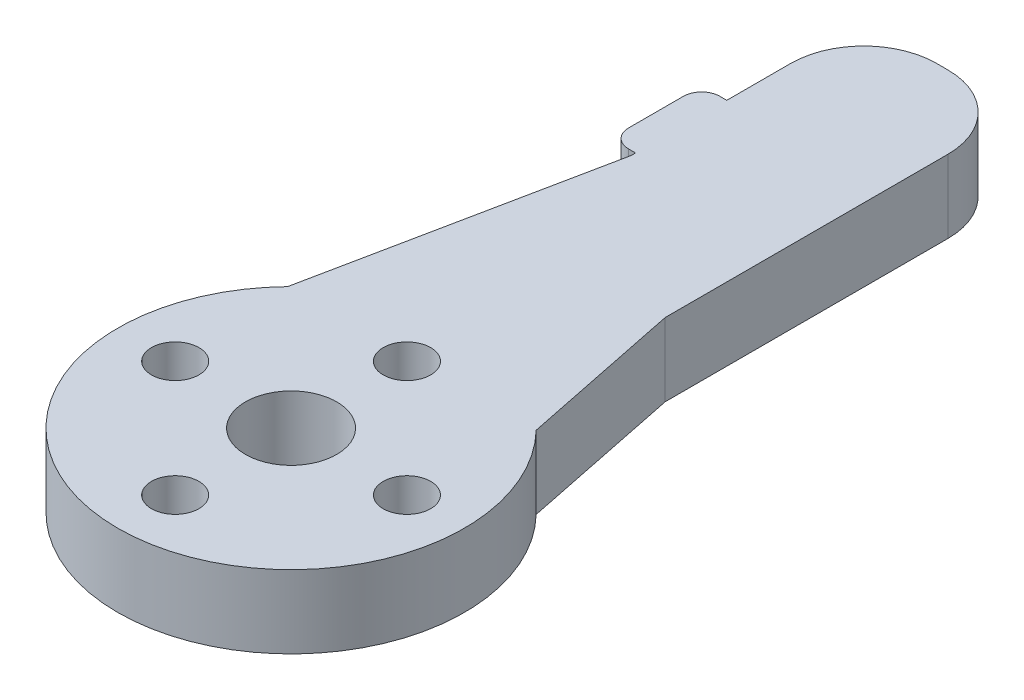
ISO-10303-21;
HEADER;
FILE_DESCRIPTION(('STEP AP214'),'2;1');
FILE_NAME('part.step','',(''),(''),'','','');
FILE_SCHEMA(('AUTOMOTIVE_DESIGN { 1 0 10303 214 1 1 1 1 }'));
ENDSEC;
DATA;
#1=APPLICATION_CONTEXT('core data for automotive mechanical design processes');
#2=APPLICATION_PROTOCOL_DEFINITION('international standard','automotive_design',2000,#1);
#3=PRODUCT_CONTEXT('',#1,'mechanical');
#4=PRODUCT('Part','Part','',(#3));
#5=PRODUCT_RELATED_PRODUCT_CATEGORY('part','',(#4));
#6=PRODUCT_DEFINITION_FORMATION('','',#4);
#7=PRODUCT_DEFINITION_CONTEXT('part definition',#1,'design');
#8=PRODUCT_DEFINITION('design','',#6,#7);
#9=PRODUCT_DEFINITION_SHAPE('','',#8);
#10=(LENGTH_UNIT() NAMED_UNIT(*) SI_UNIT(.MILLI.,.METRE.));
#11=(NAMED_UNIT(*) PLANE_ANGLE_UNIT() SI_UNIT($,.RADIAN.));
#12=(NAMED_UNIT(*) SI_UNIT($,.STERADIAN.) SOLID_ANGLE_UNIT());
#13=UNCERTAINTY_MEASURE_WITH_UNIT(LENGTH_MEASURE(1.E-05),#10,'distance_accuracy_value','');
#14=(GEOMETRIC_REPRESENTATION_CONTEXT(3) GLOBAL_UNCERTAINTY_ASSIGNED_CONTEXT((#13)) GLOBAL_UNIT_ASSIGNED_CONTEXT((#10,
#11,#12)) REPRESENTATION_CONTEXT('',''));
#15=CARTESIAN_POINT('',(0.,0.,0.));
#16=DIRECTION('',(0.,0.,1.));
#17=DIRECTION('',(1.,0.,0.));
#18=AXIS2_PLACEMENT_3D('',#15,#16,#17);
#19=CARTESIAN_POINT('',(0.,4.,-16.87456));
#20=DIRECTION('',(0.,1.,0.));
#21=DIRECTION('',(0.,0.,1.));
#22=AXIS2_PLACEMENT_3D('',#19,#20,#21);
#23=PLANE('',#22);
#24=CARTESIAN_POINT('',(0.,4.,-6.35));
#25=DIRECTION('',(0.,1.,0.));
#26=DIRECTION('',(0.,0.,1.));
#27=AXIS2_PLACEMENT_3D('',#24,#25,#26);
#28=CIRCLE('',#27,1.3);
#29=CARTESIAN_POINT('',(0.,4.,-5.05));
#30=VERTEX_POINT('',#29);
#31=EDGE_CURVE('E239',#30,#30,#28,.T.);
#32=ORIENTED_EDGE('',*,*,#31,.F.);
#33=EDGE_LOOP('',(#32));
#34=FACE_BOUND('',#33,.T.);
#35=CARTESIAN_POINT('',(6.35000000000018,4.,-1.79311378806878E-13));
#36=DIRECTION('',(0.,1.,0.));
#37=DIRECTION('',(0.,0.,1.));
#38=AXIS2_PLACEMENT_3D('',#35,#36,#37);
#39=CIRCLE('',#38,1.30000000000014);
#40=CARTESIAN_POINT('',(6.35000000000018,4.,1.29999999999996));
#41=VERTEX_POINT('',#40);
#42=EDGE_CURVE('E247',#41,#41,#39,.T.);
#43=ORIENTED_EDGE('',*,*,#42,.F.);
#44=EDGE_LOOP('',(#43));
#45=FACE_BOUND('',#44,.T.);
#46=CARTESIAN_POINT('',(3.58622757613755E-13,4.,6.35));
#47=DIRECTION('',(0.,1.,0.));
#48=DIRECTION('',(0.,0.,1.));
#49=AXIS2_PLACEMENT_3D('',#46,#47,#48);
#50=CIRCLE('',#49,1.30000000000039);
#51=CARTESIAN_POINT('',(3.58622757613755E-13,4.,7.65000000000039));
#52=VERTEX_POINT('',#51);
#53=EDGE_CURVE('E255',#52,#52,#50,.T.);
#54=ORIENTED_EDGE('',*,*,#53,.F.);
#55=EDGE_LOOP('',(#54));
#56=FACE_BOUND('',#55,.T.);
#57=CARTESIAN_POINT('',(-6.34999999999982,4.,1.80089029524336E-13));
#58=DIRECTION('',(0.,1.,0.));
#59=DIRECTION('',(0.,0.,1.));
#60=AXIS2_PLACEMENT_3D('',#57,#58,#59);
#61=CIRCLE('',#60,1.30000000000029);
#62=CARTESIAN_POINT('',(-6.34999999999982,4.,1.30000000000047));
#63=VERTEX_POINT('',#62);
#64=EDGE_CURVE('E230',#63,#63,#61,.T.);
#65=ORIENTED_EDGE('',*,*,#64,.F.);
#66=EDGE_LOOP('',(#65));
#67=FACE_BOUND('',#66,.T.);
#68=CARTESIAN_POINT('',(0.,4.,0.));
#69=DIRECTION('',(0.,1.,0.));
#70=DIRECTION('',(0.,0.,1.));
#71=AXIS2_PLACEMENT_3D('',#68,#69,#70);
#72=CIRCLE('',#71,2.5);
#73=CARTESIAN_POINT('',(0.,4.,2.5));
#74=VERTEX_POINT('',#73);
#75=EDGE_CURVE('E266',#74,#74,#72,.T.);
#76=ORIENTED_EDGE('',*,*,#75,.F.);
#77=EDGE_LOOP('',(#76));
#78=FACE_BOUND('',#77,.T.);
#79=DIRECTION('',(0.,0.,1.));
#80=VECTOR('',#79,1.);
#81=CARTESIAN_POINT('',(-4.99999999999999,4.,0.));
#82=LINE('',#81,#80);
#83=CARTESIAN_POINT('',(-5.,4.,-26.5));
#84=VERTEX_POINT('',#83);
#85=CARTESIAN_POINT('',(-5.,4.,-23.5));
#86=VERTEX_POINT('',#85);
#87=EDGE_CURVE('E197',#84,#86,#82,.T.);
#88=ORIENTED_EDGE('',*,*,#87,.T.);
#89=CARTESIAN_POINT('',(-4.,4.,-23.5));
#90=DIRECTION('',(0.,1.,0.));
#91=DIRECTION('',(0.,0.,1.));
#92=AXIS2_PLACEMENT_3D('',#89,#90,#91);
#93=CIRCLE('',#92,1.);
#94=CARTESIAN_POINT('',(-4.,4.,-22.5));
#95=VERTEX_POINT('',#94);
#96=EDGE_CURVE('E327',#86,#95,#93,.T.);
#97=ORIENTED_EDGE('',*,*,#96,.T.);
#98=DIRECTION('',(1.,0.,0.));
#99=VECTOR('',#98,1.);
#100=CARTESIAN_POINT('',(0.,4.,-22.5));
#101=LINE('',#100,#99);
#102=CARTESIAN_POINT('',(-3.62045359966388,4.,-22.5));
#103=VERTEX_POINT('',#102);
#104=EDGE_CURVE('E188',#95,#103,#101,.T.);
#105=ORIENTED_EDGE('',*,*,#104,.T.);
#106=DIRECTION('',(0.,0.,1.));
#107=VECTOR('',#106,1.);
#108=CARTESIAN_POINT('',(-3.62045359966388,4.,-16.87456));
#109=LINE('',#108,#107);
#110=CARTESIAN_POINT('',(-3.62045359966388,4.,-22.2634720868017));
#111=VERTEX_POINT('',#110);
#112=EDGE_CURVE('E193',#103,#111,#109,.T.);
#113=ORIENTED_EDGE('',*,*,#112,.T.);
#114=DIRECTION('',(-0.2,0.,0.979795897113271));
#115=VECTOR('',#114,1.);
#116=CARTESIAN_POINT('',(-4.53164224618782,4.,-17.7995776));
#117=LINE('',#116,#115);
#118=CARTESIAN_POINT('',(-6.81367210031021,4.,-6.61996015920445));
#119=VERTEX_POINT('',#118);
#120=EDGE_CURVE('E274',#111,#119,#117,.T.);
#121=ORIENTED_EDGE('',*,*,#120,.T.);
#122=CARTESIAN_POINT('',(0.,4.,0.));
#123=DIRECTION('',(0.,1.,0.));
#124=DIRECTION('',(0.,0.,1.));
#125=AXIS2_PLACEMENT_3D('',#122,#123,#124);
#126=CIRCLE('',#125,9.5);
#127=CARTESIAN_POINT('',(6.81367210031021,4.,-6.61996015920446));
#128=VERTEX_POINT('',#127);
#129=EDGE_CURVE('E210',#119,#128,#126,.T.);
#130=ORIENTED_EDGE('',*,*,#129,.T.);
#131=DIRECTION('',(-0.2,0.,-0.979795897113271));
#132=VECTOR('',#131,1.);
#133=CARTESIAN_POINT('',(4.53164224618782,4.,-17.7995776));
#134=LINE('',#133,#132);
#135=CARTESIAN_POINT('',(5.00000000000002,4.,-15.505102572168));
#136=VERTEX_POINT('',#135);
#137=EDGE_CURVE('E277',#128,#136,#134,.T.);
#138=ORIENTED_EDGE('',*,*,#137,.T.);
#139=DIRECTION('',(0.,0.,1.));
#140=VECTOR('',#139,1.);
#141=CARTESIAN_POINT('',(5.00000000000001,4.,0.));
#142=LINE('',#141,#140);
#143=CARTESIAN_POINT('',(5.,4.,-31.));
#144=VERTEX_POINT('',#143);
#145=EDGE_CURVE('E214',#144,#136,#142,.T.);
#146=ORIENTED_EDGE('',*,*,#145,.F.);
#147=CARTESIAN_POINT('',(1.,4.,-31.));
#148=DIRECTION('',(0.,1.,0.));
#149=DIRECTION('',(0.,0.,1.));
#150=AXIS2_PLACEMENT_3D('',#147,#148,#149);
#151=CIRCLE('',#150,4.);
#152=CARTESIAN_POINT('',(1.,4.,-35.));
#153=VERTEX_POINT('',#152);
#154=EDGE_CURVE('E298',#144,#153,#151,.T.);
#155=ORIENTED_EDGE('',*,*,#154,.T.);
#156=DIRECTION('',(-1.,0.,0.));
#157=VECTOR('',#156,1.);
#158=CARTESIAN_POINT('',(0.,4.,-35.));
#159=LINE('',#158,#157);
#160=CARTESIAN_POINT('',(0.379546400336118,4.,-35.));
#161=VERTEX_POINT('',#160);
#162=EDGE_CURVE('E203',#153,#161,#159,.T.);
#163=ORIENTED_EDGE('',*,*,#162,.T.);
#164=CARTESIAN_POINT('',(0.379546400336118,4.,-31.));
#165=DIRECTION('',(0.,1.,0.));
#166=DIRECTION('',(0.,0.,1.));
#167=AXIS2_PLACEMENT_3D('',#164,#165,#166);
#168=CIRCLE('',#167,4.);
#169=CARTESIAN_POINT('',(-3.62045359966388,4.,-31.));
#170=VERTEX_POINT('',#169);
#171=EDGE_CURVE('E301',#161,#170,#168,.T.);
#172=ORIENTED_EDGE('',*,*,#171,.T.);
#173=DIRECTION('',(0.,0.,1.));
#174=VECTOR('',#173,1.);
#175=CARTESIAN_POINT('',(-3.62045359966388,4.,-16.87456));
#176=LINE('',#175,#174);
#177=CARTESIAN_POINT('',(-3.62045359966388,4.,-27.5));
#178=VERTEX_POINT('',#177);
#179=EDGE_CURVE('E164',#170,#178,#176,.T.);
#180=ORIENTED_EDGE('',*,*,#179,.T.);
#181=DIRECTION('',(-1.,0.,0.));
#182=VECTOR('',#181,1.);
#183=CARTESIAN_POINT('',(0.,4.,-27.5));
#184=LINE('',#183,#182);
#185=CARTESIAN_POINT('',(-4.,4.,-27.5));
#186=VERTEX_POINT('',#185);
#187=EDGE_CURVE('E160',#178,#186,#184,.T.);
#188=ORIENTED_EDGE('',*,*,#187,.T.);
#189=CARTESIAN_POINT('',(-4.,4.,-26.5));
#190=DIRECTION('',(0.,1.,0.));
#191=DIRECTION('',(0.,0.,1.));
#192=AXIS2_PLACEMENT_3D('',#189,#190,#191);
#193=CIRCLE('',#192,1.);
#194=EDGE_CURVE('E324',#186,#84,#193,.T.);
#195=ORIENTED_EDGE('',*,*,#194,.T.);
#196=EDGE_LOOP('',(#88,#97,#105,#113,#121,#130,#138,#146,#155,#163,#172,#180,#188,#195));
#197=FACE_BOUND('',#196,.T.);
#198=ADVANCED_FACE('F44',(#34,#45,#56,#67,#78,#197),#23,.T.);
#199=CARTESIAN_POINT('',(0.,0.,-16.87456));
#200=DIRECTION('',(0.,1.,0.));
#201=DIRECTION('',(0.,0.,1.));
#202=AXIS2_PLACEMENT_3D('',#199,#200,#201);
#203=PLANE('',#202);
#204=CARTESIAN_POINT('',(0.,0.,-6.35));
#205=DIRECTION('',(0.,1.,0.));
#206=DIRECTION('',(0.,0.,1.));
#207=AXIS2_PLACEMENT_3D('',#204,#205,#206);
#208=CIRCLE('',#207,1.3);
#209=CARTESIAN_POINT('',(0.,0.,-5.05));
#210=VERTEX_POINT('',#209);
#211=EDGE_CURVE('E234',#210,#210,#208,.T.);
#212=ORIENTED_EDGE('',*,*,#211,.T.);
#213=EDGE_LOOP('',(#212));
#214=FACE_BOUND('',#213,.T.);
#215=CARTESIAN_POINT('',(6.35000000000018,0.,-1.79311378806878E-13));
#216=DIRECTION('',(0.,1.,0.));
#217=DIRECTION('',(0.,0.,1.));
#218=AXIS2_PLACEMENT_3D('',#215,#216,#217);
#219=CIRCLE('',#218,1.30000000000014);
#220=CARTESIAN_POINT('',(6.35000000000018,0.,1.29999999999996));
#221=VERTEX_POINT('',#220);
#222=EDGE_CURVE('E243',#221,#221,#219,.T.);
#223=ORIENTED_EDGE('',*,*,#222,.T.);
#224=EDGE_LOOP('',(#223));
#225=FACE_BOUND('',#224,.T.);
#226=CARTESIAN_POINT('',(3.58622757613755E-13,0.,6.35));
#227=DIRECTION('',(0.,1.,0.));
#228=DIRECTION('',(0.,0.,1.));
#229=AXIS2_PLACEMENT_3D('',#226,#227,#228);
#230=CIRCLE('',#229,1.30000000000039);
#231=CARTESIAN_POINT('',(3.58622757613755E-13,0.,7.65000000000039));
#232=VERTEX_POINT('',#231);
#233=EDGE_CURVE('E251',#232,#232,#230,.T.);
#234=ORIENTED_EDGE('',*,*,#233,.T.);
#235=EDGE_LOOP('',(#234));
#236=FACE_BOUND('',#235,.T.);
#237=CARTESIAN_POINT('',(-6.34999999999982,0.,1.80089029524336E-13));
#238=DIRECTION('',(0.,1.,0.));
#239=DIRECTION('',(0.,0.,1.));
#240=AXIS2_PLACEMENT_3D('',#237,#238,#239);
#241=CIRCLE('',#240,1.30000000000029);
#242=CARTESIAN_POINT('',(-6.34999999999982,0.,1.30000000000047));
#243=VERTEX_POINT('',#242);
#244=EDGE_CURVE('E259',#243,#243,#241,.T.);
#245=ORIENTED_EDGE('',*,*,#244,.T.);
#246=EDGE_LOOP('',(#245));
#247=FACE_BOUND('',#246,.T.);
#248=CARTESIAN_POINT('',(0.,0.,0.));
#249=DIRECTION('',(0.,1.,0.));
#250=DIRECTION('',(0.,0.,1.));
#251=AXIS2_PLACEMENT_3D('',#248,#249,#250);
#252=CIRCLE('',#251,2.5);
#253=CARTESIAN_POINT('',(0.,0.,2.5));
#254=VERTEX_POINT('',#253);
#255=EDGE_CURVE('E238',#254,#254,#252,.T.);
#256=ORIENTED_EDGE('',*,*,#255,.T.);
#257=EDGE_LOOP('',(#256));
#258=FACE_BOUND('',#257,.T.);
#259=DIRECTION('',(-1.,0.,0.));
#260=VECTOR('',#259,1.);
#261=CARTESIAN_POINT('',(0.,0.,-22.5));
#262=LINE('',#261,#260);
#263=CARTESIAN_POINT('',(-3.62045359966388,0.,-22.5));
#264=VERTEX_POINT('',#263);
#265=CARTESIAN_POINT('',(-4.,0.,-22.5));
#266=VERTEX_POINT('',#265);
#267=EDGE_CURVE('E177',#264,#266,#262,.T.);
#268=ORIENTED_EDGE('',*,*,#267,.T.);
#269=CARTESIAN_POINT('',(-4.,0.,-23.5));
#270=DIRECTION('',(0.,1.,0.));
#271=DIRECTION('',(0.,0.,1.));
#272=AXIS2_PLACEMENT_3D('',#269,#270,#271);
#273=CIRCLE('',#272,1.);
#274=CARTESIAN_POINT('',(-5.,0.,-23.5));
#275=VERTEX_POINT('',#274);
#276=EDGE_CURVE('E53',#266,#275,#273,.F.);
#277=ORIENTED_EDGE('',*,*,#276,.T.);
#278=DIRECTION('',(0.,0.,1.));
#279=VECTOR('',#278,1.);
#280=CARTESIAN_POINT('',(-4.99999999999999,0.,0.));
#281=LINE('',#280,#279);
#282=CARTESIAN_POINT('',(-5.,0.,-26.5));
#283=VERTEX_POINT('',#282);
#284=EDGE_CURVE('E198',#283,#275,#281,.T.);
#285=ORIENTED_EDGE('',*,*,#284,.F.);
#286=CARTESIAN_POINT('',(-4.,0.,-26.5));
#287=DIRECTION('',(0.,1.,0.));
#288=DIRECTION('',(0.,0.,1.));
#289=AXIS2_PLACEMENT_3D('',#286,#287,#288);
#290=CIRCLE('',#289,1.);
#291=CARTESIAN_POINT('',(-4.,0.,-27.5));
#292=VERTEX_POINT('',#291);
#293=EDGE_CURVE('E60',#283,#292,#290,.F.);
#294=ORIENTED_EDGE('',*,*,#293,.T.);
#295=DIRECTION('',(1.,0.,0.));
#296=VECTOR('',#295,1.);
#297=CARTESIAN_POINT('',(0.,0.,-27.5));
#298=LINE('',#297,#296);
#299=CARTESIAN_POINT('',(-3.62045359966388,0.,-27.5));
#300=VERTEX_POINT('',#299);
#301=EDGE_CURVE('E145',#292,#300,#298,.T.);
#302=ORIENTED_EDGE('',*,*,#301,.T.);
#303=DIRECTION('',(0.,0.,-1.));
#304=VECTOR('',#303,1.);
#305=CARTESIAN_POINT('',(-3.62045359966389,0.,0.));
#306=LINE('',#305,#304);
#307=CARTESIAN_POINT('',(-3.62045359966388,0.,-31.));
#308=VERTEX_POINT('',#307);
#309=EDGE_CURVE('E149',#300,#308,#306,.T.);
#310=ORIENTED_EDGE('',*,*,#309,.T.);
#311=CARTESIAN_POINT('',(0.379546400336118,0.,-31.));
#312=DIRECTION('',(0.,1.,0.));
#313=DIRECTION('',(0.,0.,1.));
#314=AXIS2_PLACEMENT_3D('',#311,#312,#313);
#315=CIRCLE('',#314,4.);
#316=CARTESIAN_POINT('',(0.379546400336118,0.,-35.));
#317=VERTEX_POINT('',#316);
#318=EDGE_CURVE('E309',#308,#317,#315,.F.);
#319=ORIENTED_EDGE('',*,*,#318,.T.);
#320=DIRECTION('',(-1.,0.,0.));
#321=VECTOR('',#320,1.);
#322=CARTESIAN_POINT('',(0.,0.,-35.));
#323=LINE('',#322,#321);
#324=CARTESIAN_POINT('',(1.,0.,-35.));
#325=VERTEX_POINT('',#324);
#326=EDGE_CURVE('E206',#325,#317,#323,.T.);
#327=ORIENTED_EDGE('',*,*,#326,.F.);
#328=CARTESIAN_POINT('',(1.,0.,-31.));
#329=DIRECTION('',(0.,1.,0.));
#330=DIRECTION('',(0.,0.,1.));
#331=AXIS2_PLACEMENT_3D('',#328,#329,#330);
#332=CIRCLE('',#331,4.);
#333=CARTESIAN_POINT('',(5.,0.,-31.));
#334=VERTEX_POINT('',#333);
#335=EDGE_CURVE('E306',#325,#334,#332,.F.);
#336=ORIENTED_EDGE('',*,*,#335,.T.);
#337=DIRECTION('',(0.,0.,1.));
#338=VECTOR('',#337,1.);
#339=CARTESIAN_POINT('',(5.00000000000001,0.,0.));
#340=LINE('',#339,#338);
#341=CARTESIAN_POINT('',(5.00000000000002,0.,-15.505102572168));
#342=VERTEX_POINT('',#341);
#343=EDGE_CURVE('E202',#334,#342,#340,.T.);
#344=ORIENTED_EDGE('',*,*,#343,.T.);
#345=DIRECTION('',(-0.2,0.,-0.979795897113271));
#346=VECTOR('',#345,1.);
#347=CARTESIAN_POINT('',(4.53164224618782,0.,-17.7995776));
#348=LINE('',#347,#346);
#349=CARTESIAN_POINT('',(6.8136721003102,0.,-6.61996015920446));
#350=VERTEX_POINT('',#349);
#351=EDGE_CURVE('E278',#350,#342,#348,.T.);
#352=ORIENTED_EDGE('',*,*,#351,.F.);
#353=CARTESIAN_POINT('',(0.,0.,0.));
#354=DIRECTION('',(0.,1.,0.));
#355=DIRECTION('',(0.,0.,1.));
#356=AXIS2_PLACEMENT_3D('',#353,#354,#355);
#357=CIRCLE('',#356,9.5);
#358=CARTESIAN_POINT('',(-6.81367210031021,0.,-6.61996015920445));
#359=VERTEX_POINT('',#358);
#360=EDGE_CURVE('E220',#359,#350,#357,.T.);
#361=ORIENTED_EDGE('',*,*,#360,.F.);
#362=DIRECTION('',(-0.2,0.,0.979795897113271));
#363=VECTOR('',#362,1.);
#364=CARTESIAN_POINT('',(-4.53164224618782,0.,-17.7995776));
#365=LINE('',#364,#363);
#366=CARTESIAN_POINT('',(-3.62045359966388,0.,-22.2634720868017));
#367=VERTEX_POINT('',#366);
#368=EDGE_CURVE('E270',#367,#359,#365,.T.);
#369=ORIENTED_EDGE('',*,*,#368,.F.);
#370=DIRECTION('',(0.,0.,-1.));
#371=VECTOR('',#370,1.);
#372=CARTESIAN_POINT('',(-3.62045359966388,0.,0.));
#373=LINE('',#372,#371);
#374=EDGE_CURVE('E180',#367,#264,#373,.T.);
#375=ORIENTED_EDGE('',*,*,#374,.T.);
#376=EDGE_LOOP('',(#268,#277,#285,#294,#302,#310,#319,#327,#336,#344,#352,#361,#369,#375));
#377=FACE_BOUND('',#376,.T.);
#378=ADVANCED_FACE('F147',(#214,#225,#236,#247,#258,#377),#203,.F.);
#379=CARTESIAN_POINT('',(-4.99999999999999,0.,0.));
#380=DIRECTION('',(-1.,0.,0.));
#381=DIRECTION('',(0.,0.,1.));
#382=AXIS2_PLACEMENT_3D('',#379,#380,#381);
#383=PLANE('',#382);
#384=ORIENTED_EDGE('',*,*,#284,.T.);
#385=DIRECTION('',(0.,1.,0.));
#386=VECTOR('',#385,1.);
#387=CARTESIAN_POINT('',(-5.,0.,-23.5));
#388=LINE('',#387,#386);
#389=EDGE_CURVE('E320',#275,#86,#388,.T.);
#390=ORIENTED_EDGE('',*,*,#389,.T.);
#391=ORIENTED_EDGE('',*,*,#87,.F.);
#392=DIRECTION('',(0.,-1.,0.));
#393=VECTOR('',#392,1.);
#394=CARTESIAN_POINT('',(-5.,0.,-26.5));
#395=LINE('',#394,#393);
#396=EDGE_CURVE('E316',#84,#283,#395,.T.);
#397=ORIENTED_EDGE('',*,*,#396,.T.);
#398=EDGE_LOOP('',(#384,#390,#391,#397));
#399=FACE_BOUND('',#398,.T.);
#400=ADVANCED_FACE('F338',(#399),#383,.T.);
#401=CARTESIAN_POINT('',(0.,0.,-35.));
#402=DIRECTION('',(0.,0.,-1.));
#403=DIRECTION('',(-1.,0.,0.));
#404=AXIS2_PLACEMENT_3D('',#401,#402,#403);
#405=PLANE('',#404);
#406=ORIENTED_EDGE('',*,*,#326,.T.);
#407=DIRECTION('',(0.,1.,0.));
#408=VECTOR('',#407,1.);
#409=CARTESIAN_POINT('',(0.379546400336118,0.,-35.));
#410=LINE('',#409,#408);
#411=EDGE_CURVE('E294',#317,#161,#410,.T.);
#412=ORIENTED_EDGE('',*,*,#411,.T.);
#413=ORIENTED_EDGE('',*,*,#162,.F.);
#414=DIRECTION('',(0.,1.,0.));
#415=VECTOR('',#414,1.);
#416=CARTESIAN_POINT('',(1.,0.,-35.));
#417=LINE('',#416,#415);
#418=EDGE_CURVE('E291',#153,#325,#417,.F.);
#419=ORIENTED_EDGE('',*,*,#418,.T.);
#420=EDGE_LOOP('',(#406,#412,#413,#419));
#421=FACE_BOUND('',#420,.T.);
#422=ADVANCED_FACE('F375',(#421),#405,.T.);
#423=CARTESIAN_POINT('',(4.53164224618782,4.,-17.7995776));
#424=DIRECTION('',(-0.979795897113271,0.,0.2));
#425=DIRECTION('',(0.2,0.,0.979795897113271));
#426=AXIS2_PLACEMENT_3D('',#423,#424,#425);
#427=PLANE('',#426);
#428=DIRECTION('',(0.,-1.,0.));
#429=VECTOR('',#428,1.);
#430=CARTESIAN_POINT('',(5.,4.,-15.5051025721682));
#431=LINE('',#430,#429);
#432=EDGE_CURVE('E282',#136,#342,#431,.T.);
#433=ORIENTED_EDGE('',*,*,#432,.F.);
#434=ORIENTED_EDGE('',*,*,#137,.F.);
#435=DIRECTION('',(0.,1.,0.));
#436=VECTOR('',#435,1.);
#437=CARTESIAN_POINT('',(6.8136721003102,0.,-6.61996015920446));
#438=LINE('',#437,#436);
#439=EDGE_CURVE('E226',#350,#128,#438,.T.);
#440=ORIENTED_EDGE('',*,*,#439,.F.);
#441=ORIENTED_EDGE('',*,*,#351,.T.);
#442=EDGE_LOOP('',(#433,#434,#440,#441));
#443=FACE_BOUND('',#442,.T.);
#444=ADVANCED_FACE('F362',(#443),#427,.F.);
#445=CARTESIAN_POINT('',(-4.53164224618782,4.,-17.7995776));
#446=DIRECTION('',(0.979795897113271,0.,0.2));
#447=DIRECTION('',(0.2,0.,-0.979795897113271));
#448=AXIS2_PLACEMENT_3D('',#445,#446,#447);
#449=PLANE('',#448);
#450=ORIENTED_EDGE('',*,*,#120,.F.);
#451=DIRECTION('',(0.,-1.,0.));
#452=VECTOR('',#451,1.);
#453=CARTESIAN_POINT('',(-3.62045359966388,9.,-22.2634720868017));
#454=LINE('',#453,#452);
#455=EDGE_CURVE('E170',#111,#367,#454,.T.);
#456=ORIENTED_EDGE('',*,*,#455,.T.);
#457=ORIENTED_EDGE('',*,*,#368,.T.);
#458=DIRECTION('',(0.,1.,0.));
#459=VECTOR('',#458,1.);
#460=CARTESIAN_POINT('',(-6.81367210031021,0.,-6.61996015920445));
#461=LINE('',#460,#459);
#462=EDGE_CURVE('E223',#359,#119,#461,.T.);
#463=ORIENTED_EDGE('',*,*,#462,.T.);
#464=EDGE_LOOP('',(#450,#456,#457,#463));
#465=FACE_BOUND('',#464,.T.);
#466=ADVANCED_FACE('F358',(#465),#449,.F.);
#467=CARTESIAN_POINT('',(0.,4.,0.));
#468=DIRECTION('',(0.,-1.,0.));
#469=DIRECTION('',(0.,0.,-1.));
#470=AXIS2_PLACEMENT_3D('',#467,#468,#469);
#471=CYLINDRICAL_SURFACE('',#470,2.5);
#472=ORIENTED_EDGE('',*,*,#75,.T.);
#473=EDGE_LOOP('',(#472));
#474=FACE_BOUND('',#473,.T.);
#475=ORIENTED_EDGE('',*,*,#255,.F.);
#476=EDGE_LOOP('',(#475));
#477=FACE_BOUND('',#476,.T.);
#478=ADVANCED_FACE('F397',(#474,#477),#471,.F.);
#479=CARTESIAN_POINT('',(-6.34999999999982,0.,1.80089029524336E-13));
#480=DIRECTION('',(0.,1.,0.));
#481=DIRECTION('',(0.,0.,1.));
#482=AXIS2_PLACEMENT_3D('',#479,#480,#481);
#483=CYLINDRICAL_SURFACE('',#482,1.30000000000029);
#484=ORIENTED_EDGE('',*,*,#244,.F.);
#485=EDGE_LOOP('',(#484));
#486=FACE_BOUND('',#485,.T.);
#487=ORIENTED_EDGE('',*,*,#64,.T.);
#488=EDGE_LOOP('',(#487));
#489=FACE_BOUND('',#488,.T.);
#490=ADVANCED_FACE('F591',(#486,#489),#483,.F.);
#491=CARTESIAN_POINT('',(3.58622757613755E-13,0.,6.35));
#492=DIRECTION('',(0.,1.,0.));
#493=DIRECTION('',(0.,0.,1.));
#494=AXIS2_PLACEMENT_3D('',#491,#492,#493);
#495=CYLINDRICAL_SURFACE('',#494,1.30000000000039);
#496=ORIENTED_EDGE('',*,*,#233,.F.);
#497=EDGE_LOOP('',(#496));
#498=FACE_BOUND('',#497,.T.);
#499=ORIENTED_EDGE('',*,*,#53,.T.);
#500=EDGE_LOOP('',(#499));
#501=FACE_BOUND('',#500,.T.);
#502=ADVANCED_FACE('F584',(#498,#501),#495,.F.);
#503=CARTESIAN_POINT('',(6.35000000000018,0.,-1.79311378806878E-13));
#504=DIRECTION('',(0.,1.,0.));
#505=DIRECTION('',(0.,0.,1.));
#506=AXIS2_PLACEMENT_3D('',#503,#504,#505);
#507=CYLINDRICAL_SURFACE('',#506,1.30000000000014);
#508=ORIENTED_EDGE('',*,*,#222,.F.);
#509=EDGE_LOOP('',(#508));
#510=FACE_BOUND('',#509,.T.);
#511=ORIENTED_EDGE('',*,*,#42,.T.);
#512=EDGE_LOOP('',(#511));
#513=FACE_BOUND('',#512,.T.);
#514=ADVANCED_FACE('F577',(#510,#513),#507,.F.);
#515=CARTESIAN_POINT('',(0.,0.,-6.35));
#516=DIRECTION('',(0.,1.,0.));
#517=DIRECTION('',(0.,0.,1.));
#518=AXIS2_PLACEMENT_3D('',#515,#516,#517);
#519=CYLINDRICAL_SURFACE('',#518,1.3);
#520=ORIENTED_EDGE('',*,*,#211,.F.);
#521=EDGE_LOOP('',(#520));
#522=FACE_BOUND('',#521,.T.);
#523=ORIENTED_EDGE('',*,*,#31,.T.);
#524=EDGE_LOOP('',(#523));
#525=FACE_BOUND('',#524,.T.);
#526=ADVANCED_FACE('F523',(#522,#525),#519,.F.);
#527=CARTESIAN_POINT('',(0.,0.,0.));
#528=DIRECTION('',(0.,1.,0.));
#529=DIRECTION('',(0.,0.,1.));
#530=AXIS2_PLACEMENT_3D('',#527,#528,#529);
#531=CYLINDRICAL_SURFACE('',#530,9.5);
#532=ORIENTED_EDGE('',*,*,#129,.F.);
#533=ORIENTED_EDGE('',*,*,#462,.F.);
#534=ORIENTED_EDGE('',*,*,#360,.T.);
#535=ORIENTED_EDGE('',*,*,#439,.T.);
#536=EDGE_LOOP('',(#532,#533,#534,#535));
#537=FACE_BOUND('',#536,.T.);
#538=ADVANCED_FACE('F354',(#537),#531,.T.);
#539=CARTESIAN_POINT('',(5.00000000000001,0.,0.));
#540=DIRECTION('',(-1.,0.,0.));
#541=DIRECTION('',(0.,0.,1.));
#542=AXIS2_PLACEMENT_3D('',#539,#540,#541);
#543=PLANE('',#542);
#544=ORIENTED_EDGE('',*,*,#343,.F.);
#545=DIRECTION('',(0.,1.,0.));
#546=VECTOR('',#545,1.);
#547=CARTESIAN_POINT('',(5.,4.,-31.));
#548=LINE('',#547,#546);
#549=EDGE_CURVE('E312',#334,#144,#548,.T.);
#550=ORIENTED_EDGE('',*,*,#549,.T.);
#551=ORIENTED_EDGE('',*,*,#145,.T.);
#552=ORIENTED_EDGE('',*,*,#432,.T.);
#553=EDGE_LOOP('',(#544,#550,#551,#552));
#554=FACE_BOUND('',#553,.T.);
#555=ADVANCED_FACE('F367',(#554),#543,.F.);
#556=CARTESIAN_POINT('',(-3.62045359966389,9.,0.));
#557=DIRECTION('',(-1.,0.,0.));
#558=DIRECTION('',(0.,0.,1.));
#559=AXIS2_PLACEMENT_3D('',#556,#557,#558);
#560=PLANE('',#559);
#561=ORIENTED_EDGE('',*,*,#179,.F.);
#562=DIRECTION('',(0.,1.,0.));
#563=VECTOR('',#562,1.);
#564=CARTESIAN_POINT('',(-3.62045359966388,9.,-31.));
#565=LINE('',#564,#563);
#566=EDGE_CURVE('E168',#170,#308,#565,.F.);
#567=ORIENTED_EDGE('',*,*,#566,.T.);
#568=ORIENTED_EDGE('',*,*,#309,.F.);
#569=DIRECTION('',(0.,-1.,0.));
#570=VECTOR('',#569,1.);
#571=CARTESIAN_POINT('',(-3.62045359966388,9.,-27.5));
#572=LINE('',#571,#570);
#573=EDGE_CURVE('E154',#178,#300,#572,.T.);
#574=ORIENTED_EDGE('',*,*,#573,.F.);
#575=EDGE_LOOP('',(#561,#567,#568,#574));
#576=FACE_BOUND('',#575,.T.);
#577=ADVANCED_FACE('F166',(#576),#560,.T.);
#578=CARTESIAN_POINT('',(0.,9.,-27.5));
#579=DIRECTION('',(0.,0.,-1.));
#580=DIRECTION('',(-1.,0.,0.));
#581=AXIS2_PLACEMENT_3D('',#578,#579,#580);
#582=PLANE('',#581);
#583=ORIENTED_EDGE('',*,*,#301,.F.);
#584=DIRECTION('',(0.,-1.,0.));
#585=VECTOR('',#584,1.);
#586=CARTESIAN_POINT('',(-4.,9.,-27.5));
#587=LINE('',#586,#585);
#588=EDGE_CURVE('E11',#292,#186,#587,.F.);
#589=ORIENTED_EDGE('',*,*,#588,.T.);
#590=ORIENTED_EDGE('',*,*,#187,.F.);
#591=ORIENTED_EDGE('',*,*,#573,.T.);
#592=EDGE_LOOP('',(#583,#589,#590,#591));
#593=FACE_BOUND('',#592,.T.);
#594=ADVANCED_FACE('F158',(#593),#582,.T.);
#595=CARTESIAN_POINT('',(0.,9.,-22.5));
#596=DIRECTION('',(0.,0.,1.));
#597=DIRECTION('',(1.,0.,0.));
#598=AXIS2_PLACEMENT_3D('',#595,#596,#597);
#599=PLANE('',#598);
#600=ORIENTED_EDGE('',*,*,#104,.F.);
#601=DIRECTION('',(0.,1.,0.));
#602=VECTOR('',#601,1.);
#603=CARTESIAN_POINT('',(-4.,9.,-22.5));
#604=LINE('',#603,#602);
#605=EDGE_CURVE('E68',#95,#266,#604,.F.);
#606=ORIENTED_EDGE('',*,*,#605,.T.);
#607=ORIENTED_EDGE('',*,*,#267,.F.);
#608=DIRECTION('',(0.,-1.,0.));
#609=VECTOR('',#608,1.);
#610=CARTESIAN_POINT('',(-3.62045359966388,9.,-22.5));
#611=LINE('',#610,#609);
#612=EDGE_CURVE('E174',#103,#264,#611,.T.);
#613=ORIENTED_EDGE('',*,*,#612,.F.);
#614=EDGE_LOOP('',(#600,#606,#607,#613));
#615=FACE_BOUND('',#614,.T.);
#616=ADVANCED_FACE('F345',(#615),#599,.T.);
#617=CARTESIAN_POINT('',(-3.62045359966388,9.,0.));
#618=DIRECTION('',(-1.,0.,0.));
#619=DIRECTION('',(0.,0.,1.));
#620=AXIS2_PLACEMENT_3D('',#617,#618,#619);
#621=PLANE('',#620);
#622=ORIENTED_EDGE('',*,*,#612,.T.);
#623=ORIENTED_EDGE('',*,*,#374,.F.);
#624=ORIENTED_EDGE('',*,*,#455,.F.);
#625=ORIENTED_EDGE('',*,*,#112,.F.);
#626=EDGE_LOOP('',(#622,#623,#624,#625));
#627=FACE_BOUND('',#626,.T.);
#628=ADVANCED_FACE('F348',(#627),#621,.T.);
#629=CARTESIAN_POINT('',(0.379546400336118,0.,-31.));
#630=DIRECTION('',(0.,1.,0.));
#631=DIRECTION('',(0.,0.,1.));
#632=AXIS2_PLACEMENT_3D('',#629,#630,#631);
#633=CYLINDRICAL_SURFACE('',#632,4.);
#634=ORIENTED_EDGE('',*,*,#318,.F.);
#635=ORIENTED_EDGE('',*,*,#566,.F.);
#636=ORIENTED_EDGE('',*,*,#171,.F.);
#637=ORIENTED_EDGE('',*,*,#411,.F.);
#638=EDGE_LOOP('',(#634,#635,#636,#637));
#639=FACE_BOUND('',#638,.T.);
#640=ADVANCED_FACE('F378',(#639),#633,.T.);
#641=CARTESIAN_POINT('',(1.,0.,-31.));
#642=DIRECTION('',(0.,-1.,0.));
#643=DIRECTION('',(0.,0.,-1.));
#644=AXIS2_PLACEMENT_3D('',#641,#642,#643);
#645=CYLINDRICAL_SURFACE('',#644,4.);
#646=ORIENTED_EDGE('',*,*,#335,.F.);
#647=ORIENTED_EDGE('',*,*,#418,.F.);
#648=ORIENTED_EDGE('',*,*,#154,.F.);
#649=ORIENTED_EDGE('',*,*,#549,.F.);
#650=EDGE_LOOP('',(#646,#647,#648,#649));
#651=FACE_BOUND('',#650,.T.);
#652=ADVANCED_FACE('F371',(#651),#645,.T.);
#653=CARTESIAN_POINT('',(-4.,0.,-23.5));
#654=DIRECTION('',(0.,1.,0.));
#655=DIRECTION('',(0.,0.,1.));
#656=AXIS2_PLACEMENT_3D('',#653,#654,#655);
#657=CYLINDRICAL_SURFACE('',#656,1.);
#658=ORIENTED_EDGE('',*,*,#276,.F.);
#659=ORIENTED_EDGE('',*,*,#605,.F.);
#660=ORIENTED_EDGE('',*,*,#96,.F.);
#661=ORIENTED_EDGE('',*,*,#389,.F.);
#662=EDGE_LOOP('',(#658,#659,#660,#661));
#663=FACE_BOUND('',#662,.T.);
#664=ADVANCED_FACE('F341',(#663),#657,.T.);
#665=CARTESIAN_POINT('',(-4.,0.,-26.5));
#666=DIRECTION('',(0.,-1.,0.));
#667=DIRECTION('',(0.,0.,-1.));
#668=AXIS2_PLACEMENT_3D('',#665,#666,#667);
#669=CYLINDRICAL_SURFACE('',#668,1.);
#670=ORIENTED_EDGE('',*,*,#194,.F.);
#671=ORIENTED_EDGE('',*,*,#588,.F.);
#672=ORIENTED_EDGE('',*,*,#293,.F.);
#673=ORIENTED_EDGE('',*,*,#396,.F.);
#674=EDGE_LOOP('',(#670,#671,#672,#673));
#675=FACE_BOUND('',#674,.T.);
#676=ADVANCED_FACE('F46',(#675),#669,.T.);
#677=CLOSED_SHELL('',(#198,#378,#400,#422,#444,#466,#478,#490,#502,#514,#526,#538,#555,#577,
#594,#616,#628,#640,#652,#664,#676));
#678=MANIFOLD_SOLID_BREP('B2',#677);
#679=ADVANCED_BREP_SHAPE_REPRESENTATION('',(#18,#678),#14);
#680=SHAPE_DEFINITION_REPRESENTATION(#9,#679);
ENDSEC;
END-ISO-10303-21;
